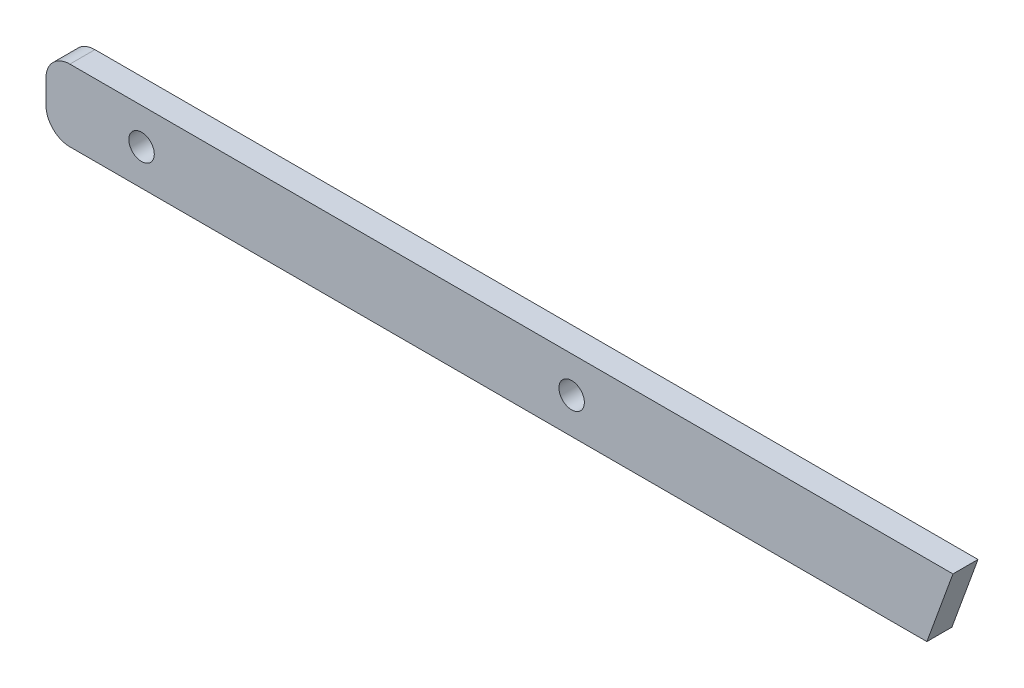
ISO-10303-21;
HEADER;
FILE_DESCRIPTION(('STEP AP214'),'2;1');
FILE_NAME('part.step','',(''),(''),'','','');
FILE_SCHEMA(('AUTOMOTIVE_DESIGN { 1 0 10303 214 1 1 1 1 }'));
ENDSEC;
DATA;
#1=APPLICATION_CONTEXT('core data for automotive mechanical design processes');
#2=APPLICATION_PROTOCOL_DEFINITION('international standard','automotive_design',2000,#1);
#3=PRODUCT_CONTEXT('',#1,'mechanical');
#4=PRODUCT('Part','Part','',(#3));
#5=PRODUCT_RELATED_PRODUCT_CATEGORY('part','',(#4));
#6=PRODUCT_DEFINITION_FORMATION('','',#4);
#7=PRODUCT_DEFINITION_CONTEXT('part definition',#1,'design');
#8=PRODUCT_DEFINITION('design','',#6,#7);
#9=PRODUCT_DEFINITION_SHAPE('','',#8);
#10=(LENGTH_UNIT() NAMED_UNIT(*) SI_UNIT(.MILLI.,.METRE.));
#11=(NAMED_UNIT(*) PLANE_ANGLE_UNIT() SI_UNIT($,.RADIAN.));
#12=(NAMED_UNIT(*) SI_UNIT($,.STERADIAN.) SOLID_ANGLE_UNIT());
#13=UNCERTAINTY_MEASURE_WITH_UNIT(LENGTH_MEASURE(1.E-05),#10,'distance_accuracy_value','');
#14=(GEOMETRIC_REPRESENTATION_CONTEXT(3) GLOBAL_UNCERTAINTY_ASSIGNED_CONTEXT((#13)) GLOBAL_UNIT_ASSIGNED_CONTEXT((#10,
#11,#12)) REPRESENTATION_CONTEXT('',''));
#15=CARTESIAN_POINT('',(0.,0.,0.));
#16=DIRECTION('',(0.,0.,1.));
#17=DIRECTION('',(1.,0.,0.));
#18=AXIS2_PLACEMENT_3D('',#15,#16,#17);
#19=CARTESIAN_POINT('',(-0.55938940169234,-29.386146661385,-9.525));
#20=DIRECTION('',(0.939692620785907,-0.342020143325672,0.));
#21=DIRECTION('',(0.342020143325672,0.939692620785907,0.));
#22=AXIS2_PLACEMENT_3D('',#19,#20,#21);
#23=PLANE('',#22);
#24=DIRECTION('',(-0.342020143325672,-0.939692620785907,0.));
#25=VECTOR('',#24,1.);
#26=CARTESIAN_POINT('',(12.9780644997125,7.80770224963224,-3.32740000000001));
#27=LINE('',#26,#25);
#28=CARTESIAN_POINT('',(17.0699262456043,19.05,-3.32740000000001));
#29=VERTEX_POINT('',#28);
#30=CARTESIAN_POINT('',(10.1362932828331,0.,-3.32740000000001));
#31=VERTEX_POINT('',#30);
#32=EDGE_CURVE('E115',#29,#31,#27,.T.);
#33=ORIENTED_EDGE('',*,*,#32,.F.);
#34=DIRECTION('',(0.,0.,-1.));
#35=VECTOR('',#34,1.);
#36=CARTESIAN_POINT('',(17.0699262456043,19.05,-3.32740000000001));
#37=LINE('',#36,#35);
#38=CARTESIAN_POINT('',(17.0699262456043,19.05,3.32739999999999));
#39=VERTEX_POINT('',#38);
#40=EDGE_CURVE('E95',#39,#29,#37,.T.);
#41=ORIENTED_EDGE('',*,*,#40,.F.);
#42=DIRECTION('',(0.342020143325672,0.939692620785907,0.));
#43=VECTOR('',#42,1.);
#44=CARTESIAN_POINT('',(12.9780644997125,7.80770224963224,3.3274));
#45=LINE('',#44,#43);
#46=CARTESIAN_POINT('',(10.1362932828331,0.,3.32740000000001));
#47=VERTEX_POINT('',#46);
#48=EDGE_CURVE('E89',#47,#39,#45,.T.);
#49=ORIENTED_EDGE('',*,*,#48,.F.);
#50=DIRECTION('',(0.,0.,1.));
#51=VECTOR('',#50,1.);
#52=CARTESIAN_POINT('',(10.1362932828331,0.,-3.32740000000001));
#53=LINE('',#52,#51);
#54=EDGE_CURVE('E92',#31,#47,#53,.T.);
#55=ORIENTED_EDGE('',*,*,#54,.F.);
#56=EDGE_LOOP('',(#33,#41,#49,#55));
#57=FACE_BOUND('',#56,.T.);
#58=ADVANCED_FACE('F35',(#57),#23,.T.);
#59=CARTESIAN_POINT('',(-223.965917593072,0.,0.));
#60=DIRECTION('',(1.,0.,0.));
#61=DIRECTION('',(0.,0.,-1.));
#62=AXIS2_PLACEMENT_3D('',#59,#60,#61);
#63=PLANE('',#62);
#64=DIRECTION('',(0.,-1.,0.));
#65=VECTOR('',#64,1.);
#66=CARTESIAN_POINT('',(-223.965917593072,0.,-3.32740000000001));
#67=LINE('',#66,#65);
#68=CARTESIAN_POINT('',(-223.965917593072,12.7,-3.32740000000001));
#69=VERTEX_POINT('',#68);
#70=CARTESIAN_POINT('',(-223.965917593072,6.34999999999997,-3.32740000000001));
#71=VERTEX_POINT('',#70);
#72=EDGE_CURVE('E111',#69,#71,#67,.T.);
#73=ORIENTED_EDGE('',*,*,#72,.T.);
#74=DIRECTION('',(0.,0.,1.));
#75=VECTOR('',#74,1.);
#76=CARTESIAN_POINT('',(-223.965917593072,6.34999999999997,3.32740000000001));
#77=LINE('',#76,#75);
#78=CARTESIAN_POINT('',(-223.965917593072,6.34999999999997,3.3274));
#79=VERTEX_POINT('',#78);
#80=EDGE_CURVE('E129',#71,#79,#77,.T.);
#81=ORIENTED_EDGE('',*,*,#80,.T.);
#82=DIRECTION('',(0.,1.,0.));
#83=VECTOR('',#82,1.);
#84=CARTESIAN_POINT('',(-223.965917593072,0.,3.32740000000001));
#85=LINE('',#84,#83);
#86=CARTESIAN_POINT('',(-223.965917593072,12.7,3.3274));
#87=VERTEX_POINT('',#86);
#88=EDGE_CURVE('E108',#79,#87,#85,.T.);
#89=ORIENTED_EDGE('',*,*,#88,.T.);
#90=DIRECTION('',(0.,0.,-1.));
#91=VECTOR('',#90,1.);
#92=CARTESIAN_POINT('',(-223.965917593072,12.7,-3.32740000000001));
#93=LINE('',#92,#91);
#94=EDGE_CURVE('E122',#87,#69,#93,.T.);
#95=ORIENTED_EDGE('',*,*,#94,.T.);
#96=EDGE_LOOP('',(#73,#81,#89,#95));
#97=FACE_BOUND('',#96,.T.);
#98=ADVANCED_FACE('F142',(#97),#63,.F.);
#99=CARTESIAN_POINT('',(34.4295501284019,0.,-3.32740000000001));
#100=DIRECTION('',(0.,-1.,0.));
#101=DIRECTION('',(1.,0.,0.));
#102=AXIS2_PLACEMENT_3D('',#99,#100,#101);
#103=PLANE('',#102);
#104=DIRECTION('',(-1.,0.,0.));
#105=VECTOR('',#104,1.);
#106=CARTESIAN_POINT('',(34.4295501284019,0.,3.32740000000001));
#107=LINE('',#106,#105);
#108=CARTESIAN_POINT('',(-217.615917593072,0.,3.32740000000001));
#109=VERTEX_POINT('',#108);
#110=EDGE_CURVE('E100',#47,#109,#107,.T.);
#111=ORIENTED_EDGE('',*,*,#110,.T.);
#112=DIRECTION('',(0.,0.,1.));
#113=VECTOR('',#112,1.);
#114=CARTESIAN_POINT('',(-217.615917593072,0.,-3.32740000000001));
#115=LINE('',#114,#113);
#116=CARTESIAN_POINT('',(-217.615917593072,0.,-3.32740000000001));
#117=VERTEX_POINT('',#116);
#118=EDGE_CURVE('E58',#109,#117,#115,.F.);
#119=ORIENTED_EDGE('',*,*,#118,.T.);
#120=DIRECTION('',(-1.,0.,0.));
#121=VECTOR('',#120,1.);
#122=CARTESIAN_POINT('',(34.4295501284019,0.,-3.32740000000001));
#123=LINE('',#122,#121);
#124=EDGE_CURVE('E107',#31,#117,#123,.T.);
#125=ORIENTED_EDGE('',*,*,#124,.F.);
#126=ORIENTED_EDGE('',*,*,#54,.T.);
#127=EDGE_LOOP('',(#111,#119,#125,#126));
#128=FACE_BOUND('',#127,.T.);
#129=ADVANCED_FACE('F106',(#128),#103,.T.);
#130=CARTESIAN_POINT('',(34.4295501284019,0.,3.32740000000001));
#131=DIRECTION('',(0.,0.,1.));
#132=DIRECTION('',(0.,-1.,0.));
#133=AXIS2_PLACEMENT_3D('',#130,#131,#132);
#134=PLANE('',#133);
#135=CARTESIAN_POINT('',(-198.565917593072,9.52499999999997,3.3274));
#136=DIRECTION('',(0.,0.,1.));
#137=DIRECTION('',(0.,-1.,0.));
#138=AXIS2_PLACEMENT_3D('',#135,#136,#137);
#139=CIRCLE('',#138,3.3782);
#140=CARTESIAN_POINT('',(-198.565917593072,6.14679999999997,3.3274));
#141=VERTEX_POINT('',#140);
#142=EDGE_CURVE('E185',#141,#141,#139,.T.);
#143=ORIENTED_EDGE('',*,*,#142,.F.);
#144=EDGE_LOOP('',(#143));
#145=FACE_BOUND('',#144,.T.);
#146=CARTESIAN_POINT('',(-84.2659175930719,9.52499999999995,3.3274));
#147=DIRECTION('',(0.,0.,1.));
#148=DIRECTION('',(0.,-1.,0.));
#149=AXIS2_PLACEMENT_3D('',#146,#147,#148);
#150=CIRCLE('',#149,3.3782);
#151=CARTESIAN_POINT('',(-84.2659175930719,6.14679999999996,3.3274));
#152=VERTEX_POINT('',#151);
#153=EDGE_CURVE('E123',#152,#152,#150,.T.);
#154=ORIENTED_EDGE('',*,*,#153,.F.);
#155=EDGE_LOOP('',(#154));
#156=FACE_BOUND('',#155,.T.);
#157=ORIENTED_EDGE('',*,*,#88,.F.);
#158=CARTESIAN_POINT('',(-217.615917593072,6.34999999999997,3.3274));
#159=DIRECTION('',(0.,0.,1.));
#160=DIRECTION('',(0.,-1.,0.));
#161=AXIS2_PLACEMENT_3D('',#158,#159,#160);
#162=CIRCLE('',#161,6.35);
#163=EDGE_CURVE('E104',#79,#109,#162,.T.);
#164=ORIENTED_EDGE('',*,*,#163,.T.);
#165=ORIENTED_EDGE('',*,*,#110,.F.);
#166=ORIENTED_EDGE('',*,*,#48,.T.);
#167=DIRECTION('',(-1.,0.,0.));
#168=VECTOR('',#167,1.);
#169=CARTESIAN_POINT('',(34.4295501284019,19.05,3.32739999999999));
#170=LINE('',#169,#168);
#171=CARTESIAN_POINT('',(-217.615917593072,19.05,3.32739999999999));
#172=VERTEX_POINT('',#171);
#173=EDGE_CURVE('E99',#39,#172,#170,.T.);
#174=ORIENTED_EDGE('',*,*,#173,.T.);
#175=CARTESIAN_POINT('',(-217.615917593072,12.7,3.3274));
#176=DIRECTION('',(0.,0.,1.));
#177=DIRECTION('',(0.,-1.,0.));
#178=AXIS2_PLACEMENT_3D('',#175,#176,#177);
#179=CIRCLE('',#178,6.35);
#180=EDGE_CURVE('E132',#172,#87,#179,.T.);
#181=ORIENTED_EDGE('',*,*,#180,.T.);
#182=EDGE_LOOP('',(#157,#164,#165,#166,#174,#181));
#183=FACE_BOUND('',#182,.T.);
#184=ADVANCED_FACE('F103',(#145,#156,#183),#134,.T.);
#185=CARTESIAN_POINT('',(34.4295501284019,19.05,-3.32740000000001));
#186=DIRECTION('',(0.,1.,0.));
#187=DIRECTION('',(-1.,0.,0.));
#188=AXIS2_PLACEMENT_3D('',#185,#186,#187);
#189=PLANE('',#188);
#190=DIRECTION('',(-1.,0.,0.));
#191=VECTOR('',#190,1.);
#192=CARTESIAN_POINT('',(34.4295501284019,19.05,-3.32740000000001));
#193=LINE('',#192,#191);
#194=CARTESIAN_POINT('',(-217.615917593072,19.05,-3.32740000000001));
#195=VERTEX_POINT('',#194);
#196=EDGE_CURVE('E117',#29,#195,#193,.T.);
#197=ORIENTED_EDGE('',*,*,#196,.T.);
#198=DIRECTION('',(0.,0.,-1.));
#199=VECTOR('',#198,1.);
#200=CARTESIAN_POINT('',(-217.615917593072,19.05,3.32739999999999));
#201=LINE('',#200,#199);
#202=EDGE_CURVE('E11',#195,#172,#201,.F.);
#203=ORIENTED_EDGE('',*,*,#202,.T.);
#204=ORIENTED_EDGE('',*,*,#173,.F.);
#205=ORIENTED_EDGE('',*,*,#40,.T.);
#206=EDGE_LOOP('',(#197,#203,#204,#205));
#207=FACE_BOUND('',#206,.T.);
#208=ADVANCED_FACE('F167',(#207),#189,.T.);
#209=CARTESIAN_POINT('',(34.4295501284019,0.,-3.32740000000001));
#210=DIRECTION('',(0.,0.,-1.));
#211=DIRECTION('',(-1.,0.,0.));
#212=AXIS2_PLACEMENT_3D('',#209,#210,#211);
#213=PLANE('',#212);
#214=CARTESIAN_POINT('',(-198.565917593072,9.52499999999997,-3.32740000000001));
#215=DIRECTION('',(0.,0.,-1.));
#216=DIRECTION('',(-1.,0.,0.));
#217=AXIS2_PLACEMENT_3D('',#214,#215,#216);
#218=CIRCLE('',#217,3.3782);
#219=CARTESIAN_POINT('',(-201.944117593072,9.52499999999997,-3.32740000000001));
#220=VERTEX_POINT('',#219);
#221=EDGE_CURVE('E188',#220,#220,#218,.T.);
#222=ORIENTED_EDGE('',*,*,#221,.F.);
#223=EDGE_LOOP('',(#222));
#224=FACE_BOUND('',#223,.T.);
#225=CARTESIAN_POINT('',(-84.2659175930719,9.52499999999995,-3.32740000000001));
#226=DIRECTION('',(0.,0.,-1.));
#227=DIRECTION('',(-1.,0.,0.));
#228=AXIS2_PLACEMENT_3D('',#225,#226,#227);
#229=CIRCLE('',#228,3.3782);
#230=CARTESIAN_POINT('',(-87.6441175930719,9.52499999999995,-3.32740000000001));
#231=VERTEX_POINT('',#230);
#232=EDGE_CURVE('E126',#231,#231,#229,.T.);
#233=ORIENTED_EDGE('',*,*,#232,.F.);
#234=EDGE_LOOP('',(#233));
#235=FACE_BOUND('',#234,.T.);
#236=ORIENTED_EDGE('',*,*,#124,.T.);
#237=CARTESIAN_POINT('',(-217.615917593072,6.34999999999997,-3.32740000000001));
#238=DIRECTION('',(0.,0.,-1.));
#239=DIRECTION('',(-1.,0.,0.));
#240=AXIS2_PLACEMENT_3D('',#237,#238,#239);
#241=CIRCLE('',#240,6.35);
#242=EDGE_CURVE('E43',#117,#71,#241,.T.);
#243=ORIENTED_EDGE('',*,*,#242,.T.);
#244=ORIENTED_EDGE('',*,*,#72,.F.);
#245=CARTESIAN_POINT('',(-217.615917593072,12.7,-3.32740000000001));
#246=DIRECTION('',(0.,0.,-1.));
#247=DIRECTION('',(-1.,0.,0.));
#248=AXIS2_PLACEMENT_3D('',#245,#246,#247);
#249=CIRCLE('',#248,6.35);
#250=EDGE_CURVE('E50',#69,#195,#249,.T.);
#251=ORIENTED_EDGE('',*,*,#250,.T.);
#252=ORIENTED_EDGE('',*,*,#196,.F.);
#253=ORIENTED_EDGE('',*,*,#32,.T.);
#254=EDGE_LOOP('',(#236,#243,#244,#251,#252,#253));
#255=FACE_BOUND('',#254,.T.);
#256=ADVANCED_FACE('F138',(#224,#235,#255),#213,.T.);
#257=CARTESIAN_POINT('',(-84.2659175930719,9.52499999999995,-3.32740000000001));
#258=DIRECTION('',(0.,0.,-1.));
#259=DIRECTION('',(-1.,0.,0.));
#260=AXIS2_PLACEMENT_3D('',#257,#258,#259);
#261=CYLINDRICAL_SURFACE('',#260,3.3782);
#262=ORIENTED_EDGE('',*,*,#153,.T.);
#263=EDGE_LOOP('',(#262));
#264=FACE_BOUND('',#263,.T.);
#265=ORIENTED_EDGE('',*,*,#232,.T.);
#266=EDGE_LOOP('',(#265));
#267=FACE_BOUND('',#266,.T.);
#268=ADVANCED_FACE('F152',(#264,#267),#261,.F.);
#269=CARTESIAN_POINT('',(-198.565917593072,9.52499999999997,-3.32740000000001));
#270=DIRECTION('',(0.,0.,-1.));
#271=DIRECTION('',(-1.,0.,0.));
#272=AXIS2_PLACEMENT_3D('',#269,#270,#271);
#273=CYLINDRICAL_SURFACE('',#272,3.3782);
#274=ORIENTED_EDGE('',*,*,#142,.T.);
#275=EDGE_LOOP('',(#274));
#276=FACE_BOUND('',#275,.T.);
#277=ORIENTED_EDGE('',*,*,#221,.T.);
#278=EDGE_LOOP('',(#277));
#279=FACE_BOUND('',#278,.T.);
#280=ADVANCED_FACE('F146',(#276,#279),#273,.F.);
#281=CARTESIAN_POINT('',(-217.615917593072,6.34999999999997,0.));
#282=DIRECTION('',(0.,0.,-1.));
#283=DIRECTION('',(-1.,0.,0.));
#284=AXIS2_PLACEMENT_3D('',#281,#282,#283);
#285=CYLINDRICAL_SURFACE('',#284,6.35);
#286=ORIENTED_EDGE('',*,*,#242,.F.);
#287=ORIENTED_EDGE('',*,*,#118,.F.);
#288=ORIENTED_EDGE('',*,*,#163,.F.);
#289=ORIENTED_EDGE('',*,*,#80,.F.);
#290=EDGE_LOOP('',(#286,#287,#288,#289));
#291=FACE_BOUND('',#290,.T.);
#292=ADVANCED_FACE('F144',(#291),#285,.T.);
#293=CARTESIAN_POINT('',(-217.615917593072,12.7,0.));
#294=DIRECTION('',(0.,0.,1.));
#295=DIRECTION('',(1.,0.,0.));
#296=AXIS2_PLACEMENT_3D('',#293,#294,#295);
#297=CYLINDRICAL_SURFACE('',#296,6.35);
#298=ORIENTED_EDGE('',*,*,#180,.F.);
#299=ORIENTED_EDGE('',*,*,#202,.F.);
#300=ORIENTED_EDGE('',*,*,#250,.F.);
#301=ORIENTED_EDGE('',*,*,#94,.F.);
#302=EDGE_LOOP('',(#298,#299,#300,#301));
#303=FACE_BOUND('',#302,.T.);
#304=ADVANCED_FACE('F37',(#303),#297,.T.);
#305=CLOSED_SHELL('',(#58,#98,#129,#184,#208,#256,#268,#280,#292,#304));
#306=MANIFOLD_SOLID_BREP('B2',#305);
#307=ADVANCED_BREP_SHAPE_REPRESENTATION('',(#18,#306),#14);
#308=SHAPE_DEFINITION_REPRESENTATION(#9,#307);
ENDSEC;
END-ISO-10303-21;
